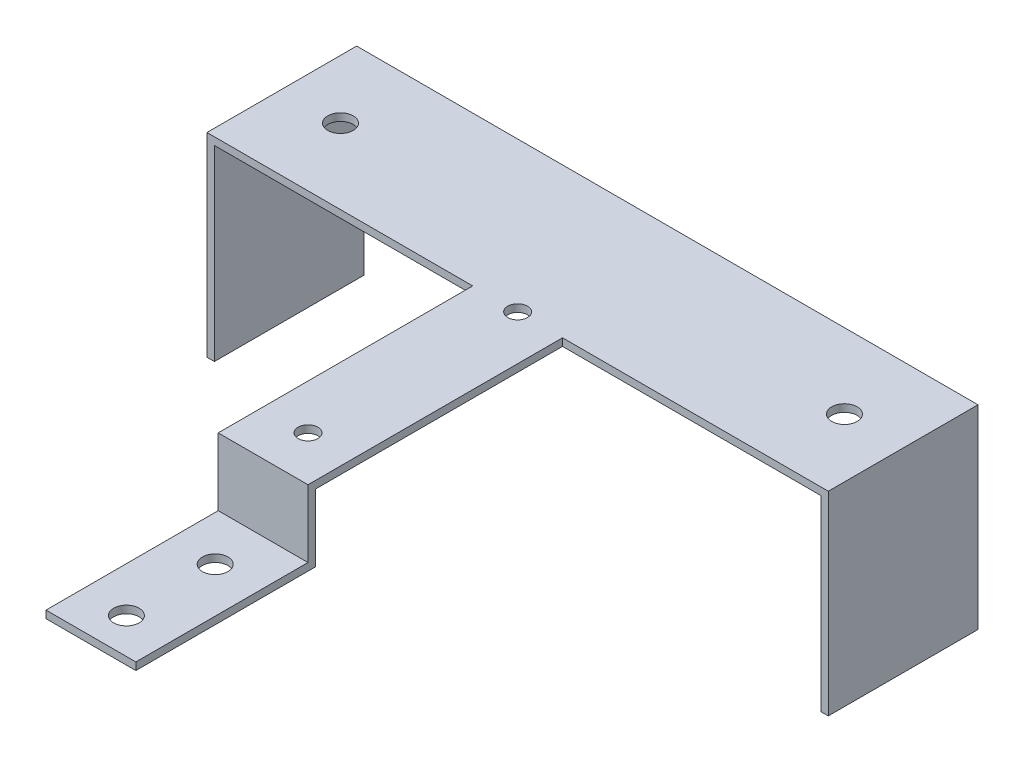
ISO-10303-21;
HEADER;
FILE_DESCRIPTION(('STEP AP214'),'2;1');
FILE_NAME('part.step','',(''),(''),'','','');
FILE_SCHEMA(('AUTOMOTIVE_DESIGN { 1 0 10303 214 1 1 1 1 }'));
ENDSEC;
DATA;
#1=APPLICATION_CONTEXT('core data for automotive mechanical design processes');
#2=APPLICATION_PROTOCOL_DEFINITION('international standard','automotive_design',2000,#1);
#3=PRODUCT_CONTEXT('',#1,'mechanical');
#4=PRODUCT('Part','Part','',(#3));
#5=PRODUCT_RELATED_PRODUCT_CATEGORY('part','',(#4));
#6=PRODUCT_DEFINITION_FORMATION('','',#4);
#7=PRODUCT_DEFINITION_CONTEXT('part definition',#1,'design');
#8=PRODUCT_DEFINITION('design','',#6,#7);
#9=PRODUCT_DEFINITION_SHAPE('','',#8);
#10=(LENGTH_UNIT() NAMED_UNIT(*) SI_UNIT(.MILLI.,.METRE.));
#11=(NAMED_UNIT(*) PLANE_ANGLE_UNIT() SI_UNIT($,.RADIAN.));
#12=(NAMED_UNIT(*) SI_UNIT($,.STERADIAN.) SOLID_ANGLE_UNIT());
#13=UNCERTAINTY_MEASURE_WITH_UNIT(LENGTH_MEASURE(1.E-05),#10,'distance_accuracy_value','');
#14=(GEOMETRIC_REPRESENTATION_CONTEXT(3) GLOBAL_UNCERTAINTY_ASSIGNED_CONTEXT((#13)) GLOBAL_UNIT_ASSIGNED_CONTEXT((#10,
#11,#12)) REPRESENTATION_CONTEXT('',''));
#15=CARTESIAN_POINT('',(0.,0.,0.));
#16=DIRECTION('',(0.,0.,1.));
#17=DIRECTION('',(1.,0.,0.));
#18=AXIS2_PLACEMENT_3D('',#15,#16,#17);
#19=CARTESIAN_POINT('',(0.,0.,0.));
#20=DIRECTION('',(0.,1.,0.));
#21=DIRECTION('',(0.,0.,1.));
#22=AXIS2_PLACEMENT_3D('',#19,#20,#21);
#23=PLANE('',#22);
#24=CARTESIAN_POINT('',(0.,0.,26.67));
#25=DIRECTION('',(0.,1.,0.));
#26=DIRECTION('',(0.,0.,1.));
#27=AXIS2_PLACEMENT_3D('',#24,#25,#26);
#28=CIRCLE('',#27,1.6764);
#29=CARTESIAN_POINT('',(0.,0.,28.3464));
#30=VERTEX_POINT('',#29);
#31=EDGE_CURVE('E265',#30,#30,#28,.T.);
#32=ORIENTED_EDGE('',*,*,#31,.T.);
#33=EDGE_LOOP('',(#32));
#34=FACE_BOUND('',#33,.T.);
#35=CARTESIAN_POINT('',(0.,0.,-8.89000000000001));
#36=DIRECTION('',(0.,1.,0.));
#37=DIRECTION('',(0.,0.,1.));
#38=AXIS2_PLACEMENT_3D('',#35,#36,#37);
#39=CIRCLE('',#38,1.6764);
#40=CARTESIAN_POINT('',(0.,0.,-7.21360000000001));
#41=VERTEX_POINT('',#40);
#42=EDGE_CURVE('E306',#41,#41,#39,.T.);
#43=ORIENTED_EDGE('',*,*,#42,.T.);
#44=EDGE_LOOP('',(#43));
#45=FACE_BOUND('',#44,.T.);
#46=CARTESIAN_POINT('',(-42.7482,0.,-21.59));
#47=DIRECTION('',(0.,1.,0.));
#48=DIRECTION('',(0.,0.,1.));
#49=AXIS2_PLACEMENT_3D('',#46,#47,#48);
#50=CIRCLE('',#49,2.159);
#51=CARTESIAN_POINT('',(-42.7482,0.,-19.431));
#52=VERTEX_POINT('',#51);
#53=EDGE_CURVE('E319',#52,#52,#50,.T.);
#54=ORIENTED_EDGE('',*,*,#53,.T.);
#55=EDGE_LOOP('',(#54));
#56=FACE_BOUND('',#55,.T.);
#57=CARTESIAN_POINT('',(42.7482,0.,-21.59));
#58=DIRECTION('',(0.,1.,0.));
#59=DIRECTION('',(0.,0.,1.));
#60=AXIS2_PLACEMENT_3D('',#57,#58,#59);
#61=CIRCLE('',#60,2.159);
#62=CARTESIAN_POINT('',(42.7482,0.,-19.431));
#63=VERTEX_POINT('',#62);
#64=EDGE_CURVE('E274',#63,#63,#61,.F.);
#65=ORIENTED_EDGE('',*,*,#64,.F.);
#66=EDGE_LOOP('',(#65));
#67=FACE_BOUND('',#66,.T.);
#68=DIRECTION('',(0.,0.,-1.));
#69=VECTOR('',#68,1.);
#70=CARTESIAN_POINT('',(51.435,0.,-8.88999999999998));
#71=LINE('',#70,#69);
#72=CARTESIAN_POINT('',(51.435,0.,-8.88999999999998));
#73=VERTEX_POINT('',#72);
#74=CARTESIAN_POINT('',(51.435,0.,-34.29));
#75=VERTEX_POINT('',#74);
#76=EDGE_CURVE('E75',#73,#75,#71,.T.);
#77=ORIENTED_EDGE('',*,*,#76,.F.);
#78=DIRECTION('',(1.,0.,0.));
#79=VECTOR('',#78,1.);
#80=CARTESIAN_POINT('',(0.,0.,-8.89000000000002));
#81=LINE('',#80,#79);
#82=CARTESIAN_POINT('',(7.62000000000001,0.,-8.89000000000001));
#83=VERTEX_POINT('',#82);
#84=EDGE_CURVE('E311',#83,#73,#81,.T.);
#85=ORIENTED_EDGE('',*,*,#84,.F.);
#86=DIRECTION('',(0.,0.,1.));
#87=VECTOR('',#86,1.);
#88=CARTESIAN_POINT('',(7.62000000000001,0.,0.));
#89=LINE('',#88,#87);
#90=CARTESIAN_POINT('',(7.62000000000001,0.,33.02));
#91=VERTEX_POINT('',#90);
#92=EDGE_CURVE('E309',#83,#91,#89,.T.);
#93=ORIENTED_EDGE('',*,*,#92,.T.);
#94=DIRECTION('',(1.,0.,0.));
#95=VECTOR('',#94,1.);
#96=CARTESIAN_POINT('',(0.,0.,33.02));
#97=LINE('',#96,#95);
#98=CARTESIAN_POINT('',(-7.61999999999999,0.,33.02));
#99=VERTEX_POINT('',#98);
#100=EDGE_CURVE('E257',#99,#91,#97,.T.);
#101=ORIENTED_EDGE('',*,*,#100,.F.);
#102=DIRECTION('',(0.,0.,1.));
#103=VECTOR('',#102,1.);
#104=CARTESIAN_POINT('',(-7.61999999999999,0.,0.));
#105=LINE('',#104,#103);
#106=CARTESIAN_POINT('',(-7.61999999999999,0.,-8.89000000000001));
#107=VERTEX_POINT('',#106);
#108=EDGE_CURVE('E316',#107,#99,#105,.T.);
#109=ORIENTED_EDGE('',*,*,#108,.F.);
#110=DIRECTION('',(1.,0.,0.));
#111=VECTOR('',#110,1.);
#112=CARTESIAN_POINT('',(0.,0.,-8.89000000000002));
#113=LINE('',#112,#111);
#114=CARTESIAN_POINT('',(-51.435,0.,-8.88999999999997));
#115=VERTEX_POINT('',#114);
#116=EDGE_CURVE('E314',#115,#107,#113,.T.);
#117=ORIENTED_EDGE('',*,*,#116,.F.);
#118=DIRECTION('',(0.,0.,-1.));
#119=VECTOR('',#118,1.);
#120=CARTESIAN_POINT('',(-51.435,0.,-8.88999999999997));
#121=LINE('',#120,#119);
#122=CARTESIAN_POINT('',(-51.435,0.,-34.29));
#123=VERTEX_POINT('',#122);
#124=EDGE_CURVE('E207',#115,#123,#121,.T.);
#125=ORIENTED_EDGE('',*,*,#124,.T.);
#126=DIRECTION('',(1.,0.,0.));
#127=VECTOR('',#126,1.);
#128=CARTESIAN_POINT('',(0.,0.,-34.29));
#129=LINE('',#128,#127);
#130=EDGE_CURVE('E80',#123,#75,#129,.T.);
#131=ORIENTED_EDGE('',*,*,#130,.T.);
#132=EDGE_LOOP('',(#77,#85,#93,#101,#109,#117,#125,#131));
#133=FACE_BOUND('',#132,.T.);
#134=ADVANCED_FACE('F60',(#34,#45,#56,#67,#133),#23,.F.);
#135=CARTESIAN_POINT('',(0.,1.27,34.29));
#136=DIRECTION('',(0.,0.,-1.));
#137=DIRECTION('',(-1.,0.,0.));
#138=AXIS2_PLACEMENT_3D('',#135,#136,#137);
#139=PLANE('',#138);
#140=DIRECTION('',(-1.,0.,0.));
#141=VECTOR('',#140,1.);
#142=CARTESIAN_POINT('',(7.62000000000001,-10.16,34.29));
#143=LINE('',#142,#141);
#144=CARTESIAN_POINT('',(7.62000000000001,-10.16,34.29));
#145=VERTEX_POINT('',#144);
#146=CARTESIAN_POINT('',(-7.61999999999999,-10.16,34.29));
#147=VERTEX_POINT('',#146);
#148=EDGE_CURVE('E231',#145,#147,#143,.T.);
#149=ORIENTED_EDGE('',*,*,#148,.F.);
#150=DIRECTION('',(0.,-1.,0.));
#151=VECTOR('',#150,1.);
#152=CARTESIAN_POINT('',(7.62000000000001,1.27,34.29));
#153=LINE('',#152,#151);
#154=CARTESIAN_POINT('',(7.62000000000001,1.27,34.29));
#155=VERTEX_POINT('',#154);
#156=EDGE_CURVE('E303',#155,#145,#153,.T.);
#157=ORIENTED_EDGE('',*,*,#156,.F.);
#158=DIRECTION('',(1.,0.,0.));
#159=VECTOR('',#158,1.);
#160=CARTESIAN_POINT('',(0.,1.27,34.29));
#161=LINE('',#160,#159);
#162=CARTESIAN_POINT('',(-7.61999999999999,1.27,34.29));
#163=VERTEX_POINT('',#162);
#164=EDGE_CURVE('E295',#163,#155,#161,.T.);
#165=ORIENTED_EDGE('',*,*,#164,.F.);
#166=DIRECTION('',(0.,-1.,0.));
#167=VECTOR('',#166,1.);
#168=CARTESIAN_POINT('',(-7.61999999999999,1.27,34.29));
#169=LINE('',#168,#167);
#170=EDGE_CURVE('E326',#163,#147,#169,.T.);
#171=ORIENTED_EDGE('',*,*,#170,.T.);
#172=EDGE_LOOP('',(#149,#157,#165,#171));
#173=FACE_BOUND('',#172,.T.);
#174=ADVANCED_FACE('F378',(#173),#139,.F.);
#175=CARTESIAN_POINT('',(7.62000000000001,1.27,0.));
#176=DIRECTION('',(1.,0.,0.));
#177=DIRECTION('',(0.,0.,-1.));
#178=AXIS2_PLACEMENT_3D('',#175,#176,#177);
#179=PLANE('',#178);
#180=ORIENTED_EDGE('',*,*,#92,.F.);
#181=DIRECTION('',(0.,-1.,0.));
#182=VECTOR('',#181,1.);
#183=CARTESIAN_POINT('',(7.62000000000001,1.27,-8.89000000000001));
#184=LINE('',#183,#182);
#185=CARTESIAN_POINT('',(7.62000000000001,1.27,-8.89000000000001));
#186=VERTEX_POINT('',#185);
#187=EDGE_CURVE('E12',#186,#83,#184,.T.);
#188=ORIENTED_EDGE('',*,*,#187,.F.);
#189=DIRECTION('',(0.,0.,1.));
#190=VECTOR('',#189,1.);
#191=CARTESIAN_POINT('',(7.62000000000001,1.27,0.));
#192=LINE('',#191,#190);
#193=EDGE_CURVE('E277',#186,#155,#192,.T.);
#194=ORIENTED_EDGE('',*,*,#193,.T.);
#195=ORIENTED_EDGE('',*,*,#156,.T.);
#196=DIRECTION('',(0.,0.,-1.));
#197=VECTOR('',#196,1.);
#198=CARTESIAN_POINT('',(7.62000000000001,-10.16,63.5));
#199=LINE('',#198,#197);
#200=CARTESIAN_POINT('',(7.62000000000001,-10.16,63.5));
#201=VERTEX_POINT('',#200);
#202=EDGE_CURVE('E250',#201,#145,#199,.T.);
#203=ORIENTED_EDGE('',*,*,#202,.F.);
#204=DIRECTION('',(0.,1.,0.));
#205=VECTOR('',#204,1.);
#206=CARTESIAN_POINT('',(7.62000000000001,-11.43,63.5));
#207=LINE('',#206,#205);
#208=CARTESIAN_POINT('',(7.62000000000001,-11.43,63.5));
#209=VERTEX_POINT('',#208);
#210=EDGE_CURVE('E234',#209,#201,#207,.T.);
#211=ORIENTED_EDGE('',*,*,#210,.F.);
#212=DIRECTION('',(0.,0.,-1.));
#213=VECTOR('',#212,1.);
#214=CARTESIAN_POINT('',(7.62000000000001,-11.43,34.29));
#215=LINE('',#214,#213);
#216=CARTESIAN_POINT('',(7.62000000000001,-11.43,33.02));
#217=VERTEX_POINT('',#216);
#218=EDGE_CURVE('E253',#209,#217,#215,.T.);
#219=ORIENTED_EDGE('',*,*,#218,.T.);
#220=DIRECTION('',(0.,1.,0.));
#221=VECTOR('',#220,1.);
#222=CARTESIAN_POINT('',(7.62000000000001,-11.43,33.02));
#223=LINE('',#222,#221);
#224=EDGE_CURVE('E262',#217,#91,#223,.T.);
#225=ORIENTED_EDGE('',*,*,#224,.T.);
#226=EDGE_LOOP('',(#180,#188,#194,#195,#203,#211,#219,#225));
#227=FACE_BOUND('',#226,.T.);
#228=ADVANCED_FACE('F344',(#227),#179,.T.);
#229=CARTESIAN_POINT('',(0.,1.27,-8.89000000000002));
#230=DIRECTION('',(0.,0.,-1.));
#231=DIRECTION('',(-1.,0.,0.));
#232=AXIS2_PLACEMENT_3D('',#229,#230,#231);
#233=PLANE('',#232);
#234=ORIENTED_EDGE('',*,*,#84,.T.);
#235=DIRECTION('',(0.,1.,0.));
#236=VECTOR('',#235,1.);
#237=CARTESIAN_POINT('',(51.435,-31.75,-8.88999999999998));
#238=LINE('',#237,#236);
#239=CARTESIAN_POINT('',(51.435,-31.75,-8.88999999999998));
#240=VERTEX_POINT('',#239);
#241=EDGE_CURVE('E188',#240,#73,#238,.T.);
#242=ORIENTED_EDGE('',*,*,#241,.F.);
#243=DIRECTION('',(-1.,0.,0.));
#244=VECTOR('',#243,1.);
#245=CARTESIAN_POINT('',(52.705,-31.75,-8.88999999999998));
#246=LINE('',#245,#244);
#247=CARTESIAN_POINT('',(52.705,-31.75,-8.88999999999998));
#248=VERTEX_POINT('',#247);
#249=EDGE_CURVE('E185',#248,#240,#246,.T.);
#250=ORIENTED_EDGE('',*,*,#249,.F.);
#251=DIRECTION('',(0.,-1.,0.));
#252=VECTOR('',#251,1.);
#253=CARTESIAN_POINT('',(52.705,1.27,-8.88999999999998));
#254=LINE('',#253,#252);
#255=CARTESIAN_POINT('',(52.705,1.27,-8.88999999999998));
#256=VERTEX_POINT('',#255);
#257=EDGE_CURVE('E68',#256,#248,#254,.T.);
#258=ORIENTED_EDGE('',*,*,#257,.F.);
#259=DIRECTION('',(1.,0.,0.));
#260=VECTOR('',#259,1.);
#261=CARTESIAN_POINT('',(0.,1.27,-8.89000000000002));
#262=LINE('',#261,#260);
#263=EDGE_CURVE('E280',#186,#256,#262,.T.);
#264=ORIENTED_EDGE('',*,*,#263,.F.);
#265=ORIENTED_EDGE('',*,*,#187,.T.);
#266=EDGE_LOOP('',(#234,#242,#250,#258,#264,#265));
#267=FACE_BOUND('',#266,.T.);
#268=ADVANCED_FACE('F186',(#267),#233,.F.);
#269=CARTESIAN_POINT('',(52.705,1.27,0.));
#270=DIRECTION('',(1.,0.,0.));
#271=DIRECTION('',(0.,0.,-1.));
#272=AXIS2_PLACEMENT_3D('',#269,#270,#271);
#273=PLANE('',#272);
#274=ORIENTED_EDGE('',*,*,#257,.T.);
#275=DIRECTION('',(0.,0.,-1.));
#276=VECTOR('',#275,1.);
#277=CARTESIAN_POINT('',(52.705,-31.75,-8.88999999999998));
#278=LINE('',#277,#276);
#279=CARTESIAN_POINT('',(52.705,-31.75,-34.29));
#280=VERTEX_POINT('',#279);
#281=EDGE_CURVE('E177',#248,#280,#278,.T.);
#282=ORIENTED_EDGE('',*,*,#281,.T.);
#283=DIRECTION('',(0.,-1.,0.));
#284=VECTOR('',#283,1.);
#285=CARTESIAN_POINT('',(52.705,1.27,-34.29));
#286=LINE('',#285,#284);
#287=CARTESIAN_POINT('',(52.705,1.27,-34.29));
#288=VERTEX_POINT('',#287);
#289=EDGE_CURVE('E182',#288,#280,#286,.T.);
#290=ORIENTED_EDGE('',*,*,#289,.F.);
#291=DIRECTION('',(0.,0.,1.));
#292=VECTOR('',#291,1.);
#293=CARTESIAN_POINT('',(52.705,1.27,0.));
#294=LINE('',#293,#292);
#295=EDGE_CURVE('E179',#288,#256,#294,.T.);
#296=ORIENTED_EDGE('',*,*,#295,.T.);
#297=EDGE_LOOP('',(#274,#282,#290,#296));
#298=FACE_BOUND('',#297,.T.);
#299=ADVANCED_FACE('F175',(#298),#273,.T.);
#300=CARTESIAN_POINT('',(0.,1.27,-34.29));
#301=DIRECTION('',(0.,0.,-1.));
#302=DIRECTION('',(-1.,0.,0.));
#303=AXIS2_PLACEMENT_3D('',#300,#301,#302);
#304=PLANE('',#303);
#305=ORIENTED_EDGE('',*,*,#130,.F.);
#306=DIRECTION('',(0.,1.,0.));
#307=VECTOR('',#306,1.);
#308=CARTESIAN_POINT('',(-51.435,-31.75,-34.29));
#309=LINE('',#308,#307);
#310=CARTESIAN_POINT('',(-51.435,-31.75,-34.29));
#311=VERTEX_POINT('',#310);
#312=EDGE_CURVE('E217',#311,#123,#309,.T.);
#313=ORIENTED_EDGE('',*,*,#312,.F.);
#314=DIRECTION('',(1.,0.,0.));
#315=VECTOR('',#314,1.);
#316=CARTESIAN_POINT('',(-52.705,-31.75,-34.29));
#317=LINE('',#316,#315);
#318=CARTESIAN_POINT('',(-52.705,-31.75,-34.29));
#319=VERTEX_POINT('',#318);
#320=EDGE_CURVE('E210',#319,#311,#317,.T.);
#321=ORIENTED_EDGE('',*,*,#320,.F.);
#322=DIRECTION('',(0.,-1.,0.));
#323=VECTOR('',#322,1.);
#324=CARTESIAN_POINT('',(-52.705,1.27,-34.29));
#325=LINE('',#324,#323);
#326=CARTESIAN_POINT('',(-52.705,1.27,-34.29));
#327=VERTEX_POINT('',#326);
#328=EDGE_CURVE('E333',#327,#319,#325,.T.);
#329=ORIENTED_EDGE('',*,*,#328,.F.);
#330=DIRECTION('',(1.,0.,0.));
#331=VECTOR('',#330,1.);
#332=CARTESIAN_POINT('',(0.,1.27,-34.29));
#333=LINE('',#332,#331);
#334=EDGE_CURVE('E283',#327,#288,#333,.T.);
#335=ORIENTED_EDGE('',*,*,#334,.T.);
#336=ORIENTED_EDGE('',*,*,#289,.T.);
#337=DIRECTION('',(-1.,0.,0.));
#338=VECTOR('',#337,1.);
#339=CARTESIAN_POINT('',(52.705,-31.75,-34.29));
#340=LINE('',#339,#338);
#341=CARTESIAN_POINT('',(51.435,-31.75,-34.29));
#342=VERTEX_POINT('',#341);
#343=EDGE_CURVE('E195',#280,#342,#340,.T.);
#344=ORIENTED_EDGE('',*,*,#343,.T.);
#345=DIRECTION('',(0.,1.,0.));
#346=VECTOR('',#345,1.);
#347=CARTESIAN_POINT('',(51.435,-31.75,-34.29));
#348=LINE('',#347,#346);
#349=EDGE_CURVE('E196',#342,#75,#348,.T.);
#350=ORIENTED_EDGE('',*,*,#349,.T.);
#351=EDGE_LOOP('',(#305,#313,#321,#329,#335,#336,#344,#350));
#352=FACE_BOUND('',#351,.T.);
#353=ADVANCED_FACE('F336',(#352),#304,.T.);
#354=CARTESIAN_POINT('',(-52.705,1.27,0.));
#355=DIRECTION('',(1.,0.,0.));
#356=DIRECTION('',(0.,0.,-1.));
#357=AXIS2_PLACEMENT_3D('',#354,#355,#356);
#358=PLANE('',#357);
#359=ORIENTED_EDGE('',*,*,#328,.T.);
#360=DIRECTION('',(0.,0.,-1.));
#361=VECTOR('',#360,1.);
#362=CARTESIAN_POINT('',(-52.705,-31.75,-8.88999999999997));
#363=LINE('',#362,#361);
#364=CARTESIAN_POINT('',(-52.705,-31.75,-8.88999999999997));
#365=VERTEX_POINT('',#364);
#366=EDGE_CURVE('E212',#365,#319,#363,.T.);
#367=ORIENTED_EDGE('',*,*,#366,.F.);
#368=DIRECTION('',(0.,-1.,0.));
#369=VECTOR('',#368,1.);
#370=CARTESIAN_POINT('',(-52.705,1.27,-8.88999999999997));
#371=LINE('',#370,#369);
#372=CARTESIAN_POINT('',(-52.705,1.27,-8.88999999999997));
#373=VERTEX_POINT('',#372);
#374=EDGE_CURVE('E331',#373,#365,#371,.T.);
#375=ORIENTED_EDGE('',*,*,#374,.F.);
#376=DIRECTION('',(0.,0.,1.));
#377=VECTOR('',#376,1.);
#378=CARTESIAN_POINT('',(-52.705,1.27,0.));
#379=LINE('',#378,#377);
#380=EDGE_CURVE('E286',#327,#373,#379,.T.);
#381=ORIENTED_EDGE('',*,*,#380,.F.);
#382=EDGE_LOOP('',(#359,#367,#375,#381));
#383=FACE_BOUND('',#382,.T.);
#384=ADVANCED_FACE('F403',(#383),#358,.F.);
#385=CARTESIAN_POINT('',(0.,1.27,-8.89000000000002));
#386=DIRECTION('',(0.,0.,-1.));
#387=DIRECTION('',(-1.,0.,0.));
#388=AXIS2_PLACEMENT_3D('',#385,#386,#387);
#389=PLANE('',#388);
#390=ORIENTED_EDGE('',*,*,#374,.T.);
#391=DIRECTION('',(1.,0.,0.));
#392=VECTOR('',#391,1.);
#393=CARTESIAN_POINT('',(-52.705,-31.75,-8.88999999999997));
#394=LINE('',#393,#392);
#395=CARTESIAN_POINT('',(-51.435,-31.75,-8.88999999999997));
#396=VERTEX_POINT('',#395);
#397=EDGE_CURVE('E203',#365,#396,#394,.T.);
#398=ORIENTED_EDGE('',*,*,#397,.T.);
#399=DIRECTION('',(0.,1.,0.));
#400=VECTOR('',#399,1.);
#401=CARTESIAN_POINT('',(-51.435,-31.75,-8.88999999999997));
#402=LINE('',#401,#400);
#403=EDGE_CURVE('E215',#396,#115,#402,.T.);
#404=ORIENTED_EDGE('',*,*,#403,.T.);
#405=ORIENTED_EDGE('',*,*,#116,.T.);
#406=DIRECTION('',(0.,-1.,0.));
#407=VECTOR('',#406,1.);
#408=CARTESIAN_POINT('',(-7.61999999999999,1.27,-8.89000000000001));
#409=LINE('',#408,#407);
#410=CARTESIAN_POINT('',(-7.61999999999999,1.27,-8.89000000000001));
#411=VERTEX_POINT('',#410);
#412=EDGE_CURVE('E328',#411,#107,#409,.T.);
#413=ORIENTED_EDGE('',*,*,#412,.F.);
#414=DIRECTION('',(1.,0.,0.));
#415=VECTOR('',#414,1.);
#416=CARTESIAN_POINT('',(0.,1.27,-8.89000000000002));
#417=LINE('',#416,#415);
#418=EDGE_CURVE('E289',#373,#411,#417,.T.);
#419=ORIENTED_EDGE('',*,*,#418,.F.);
#420=EDGE_LOOP('',(#390,#398,#404,#405,#413,#419));
#421=FACE_BOUND('',#420,.T.);
#422=ADVANCED_FACE('F358',(#421),#389,.F.);
#423=CARTESIAN_POINT('',(-7.61999999999999,1.27,0.));
#424=DIRECTION('',(1.,0.,0.));
#425=DIRECTION('',(0.,0.,-1.));
#426=AXIS2_PLACEMENT_3D('',#423,#424,#425);
#427=PLANE('',#426);
#428=ORIENTED_EDGE('',*,*,#108,.T.);
#429=DIRECTION('',(0.,1.,0.));
#430=VECTOR('',#429,1.);
#431=CARTESIAN_POINT('',(-7.61999999999999,-11.43,33.02));
#432=LINE('',#431,#430);
#433=CARTESIAN_POINT('',(-7.61999999999999,-11.43,33.02));
#434=VERTEX_POINT('',#433);
#435=EDGE_CURVE('E259',#434,#99,#432,.T.);
#436=ORIENTED_EDGE('',*,*,#435,.F.);
#437=DIRECTION('',(0.,0.,-1.));
#438=VECTOR('',#437,1.);
#439=CARTESIAN_POINT('',(-7.61999999999999,-11.43,0.));
#440=LINE('',#439,#438);
#441=CARTESIAN_POINT('',(-7.61999999999999,-11.43,63.5));
#442=VERTEX_POINT('',#441);
#443=EDGE_CURVE('E254',#442,#434,#440,.T.);
#444=ORIENTED_EDGE('',*,*,#443,.F.);
#445=DIRECTION('',(0.,-1.,0.));
#446=VECTOR('',#445,1.);
#447=CARTESIAN_POINT('',(-7.61999999999999,-11.43,63.5));
#448=LINE('',#447,#446);
#449=CARTESIAN_POINT('',(-7.61999999999999,-10.16,63.5));
#450=VERTEX_POINT('',#449);
#451=EDGE_CURVE('E239',#450,#442,#448,.T.);
#452=ORIENTED_EDGE('',*,*,#451,.F.);
#453=DIRECTION('',(0.,0.,-1.));
#454=VECTOR('',#453,1.);
#455=CARTESIAN_POINT('',(-7.61999999999999,-10.16,63.5));
#456=LINE('',#455,#454);
#457=EDGE_CURVE('E245',#450,#147,#456,.T.);
#458=ORIENTED_EDGE('',*,*,#457,.T.);
#459=ORIENTED_EDGE('',*,*,#170,.F.);
#460=DIRECTION('',(0.,0.,1.));
#461=VECTOR('',#460,1.);
#462=CARTESIAN_POINT('',(-7.61999999999999,1.27,0.));
#463=LINE('',#462,#461);
#464=EDGE_CURVE('E292',#411,#163,#463,.T.);
#465=ORIENTED_EDGE('',*,*,#464,.F.);
#466=ORIENTED_EDGE('',*,*,#412,.T.);
#467=EDGE_LOOP('',(#428,#436,#444,#452,#458,#459,#465,#466));
#468=FACE_BOUND('',#467,.T.);
#469=ADVANCED_FACE('F354',(#468),#427,.F.);
#470=CARTESIAN_POINT('',(-42.7482,1.27,-21.59));
#471=DIRECTION('',(0.,-1.,0.));
#472=DIRECTION('',(0.,0.,-1.));
#473=AXIS2_PLACEMENT_3D('',#470,#471,#472);
#474=CYLINDRICAL_SURFACE('',#473,2.159);
#475=CARTESIAN_POINT('',(-42.7482,1.27,-21.59));
#476=DIRECTION('',(0.,1.,0.));
#477=DIRECTION('',(0.,0.,1.));
#478=AXIS2_PLACEMENT_3D('',#475,#476,#477);
#479=CIRCLE('',#478,2.159);
#480=CARTESIAN_POINT('',(-42.7482,1.27,-19.431));
#481=VERTEX_POINT('',#480);
#482=EDGE_CURVE('E297',#481,#481,#479,.T.);
#483=ORIENTED_EDGE('',*,*,#482,.T.);
#484=EDGE_LOOP('',(#483));
#485=FACE_BOUND('',#484,.T.);
#486=ORIENTED_EDGE('',*,*,#53,.F.);
#487=EDGE_LOOP('',(#486));
#488=FACE_BOUND('',#487,.T.);
#489=ADVANCED_FACE('F394',(#485,#488),#474,.F.);
#490=CARTESIAN_POINT('',(0.,1.27,-8.89000000000001));
#491=DIRECTION('',(0.,-1.,0.));
#492=DIRECTION('',(0.,0.,-1.));
#493=AXIS2_PLACEMENT_3D('',#490,#491,#492);
#494=CYLINDRICAL_SURFACE('',#493,1.6764);
#495=CARTESIAN_POINT('',(0.,1.27,-8.89000000000001));
#496=DIRECTION('',(0.,1.,0.));
#497=DIRECTION('',(0.,0.,1.));
#498=AXIS2_PLACEMENT_3D('',#495,#496,#497);
#499=CIRCLE('',#498,1.6764);
#500=CARTESIAN_POINT('',(0.,1.27,-7.21360000000001));
#501=VERTEX_POINT('',#500);
#502=EDGE_CURVE('E273',#501,#501,#499,.T.);
#503=ORIENTED_EDGE('',*,*,#502,.T.);
#504=EDGE_LOOP('',(#503));
#505=FACE_BOUND('',#504,.T.);
#506=ORIENTED_EDGE('',*,*,#42,.F.);
#507=EDGE_LOOP('',(#506));
#508=FACE_BOUND('',#507,.T.);
#509=ADVANCED_FACE('F396',(#505,#508),#494,.F.);
#510=CARTESIAN_POINT('',(0.,1.27,26.67));
#511=DIRECTION('',(0.,-1.,0.));
#512=DIRECTION('',(0.,0.,-1.));
#513=AXIS2_PLACEMENT_3D('',#510,#511,#512);
#514=CYLINDRICAL_SURFACE('',#513,1.6764);
#515=CARTESIAN_POINT('',(0.,1.27,26.67));
#516=DIRECTION('',(0.,1.,0.));
#517=DIRECTION('',(0.,0.,1.));
#518=AXIS2_PLACEMENT_3D('',#515,#516,#517);
#519=CIRCLE('',#518,1.6764);
#520=CARTESIAN_POINT('',(0.,1.27,28.3464));
#521=VERTEX_POINT('',#520);
#522=EDGE_CURVE('E270',#521,#521,#519,.T.);
#523=ORIENTED_EDGE('',*,*,#522,.T.);
#524=EDGE_LOOP('',(#523));
#525=FACE_BOUND('',#524,.T.);
#526=ORIENTED_EDGE('',*,*,#31,.F.);
#527=EDGE_LOOP('',(#526));
#528=FACE_BOUND('',#527,.T.);
#529=ADVANCED_FACE('F62',(#525,#528),#514,.F.);
#530=CARTESIAN_POINT('',(42.7482,1.27,-21.59));
#531=DIRECTION('',(0.,-1.,0.));
#532=DIRECTION('',(0.,0.,-1.));
#533=AXIS2_PLACEMENT_3D('',#530,#531,#532);
#534=CYLINDRICAL_SURFACE('',#533,2.159);
#535=CARTESIAN_POINT('',(42.7482,1.27,-21.59));
#536=DIRECTION('',(0.,1.,0.));
#537=DIRECTION('',(0.,0.,1.));
#538=AXIS2_PLACEMENT_3D('',#535,#536,#537);
#539=CIRCLE('',#538,2.159);
#540=CARTESIAN_POINT('',(42.7482,1.27,-19.431));
#541=VERTEX_POINT('',#540);
#542=EDGE_CURVE('E300',#541,#541,#539,.F.);
#543=ORIENTED_EDGE('',*,*,#542,.F.);
#544=EDGE_LOOP('',(#543));
#545=FACE_BOUND('',#544,.T.);
#546=ORIENTED_EDGE('',*,*,#64,.T.);
#547=EDGE_LOOP('',(#546));
#548=FACE_BOUND('',#547,.T.);
#549=ADVANCED_FACE('F390',(#545,#548),#534,.F.);
#550=CARTESIAN_POINT('',(0.,1.27,0.));
#551=DIRECTION('',(0.,1.,0.));
#552=DIRECTION('',(0.,0.,1.));
#553=AXIS2_PLACEMENT_3D('',#550,#551,#552);
#554=PLANE('',#553);
#555=ORIENTED_EDGE('',*,*,#522,.F.);
#556=EDGE_LOOP('',(#555));
#557=FACE_BOUND('',#556,.T.);
#558=ORIENTED_EDGE('',*,*,#502,.F.);
#559=EDGE_LOOP('',(#558));
#560=FACE_BOUND('',#559,.T.);
#561=ORIENTED_EDGE('',*,*,#193,.F.);
#562=ORIENTED_EDGE('',*,*,#263,.T.);
#563=ORIENTED_EDGE('',*,*,#295,.F.);
#564=ORIENTED_EDGE('',*,*,#334,.F.);
#565=ORIENTED_EDGE('',*,*,#380,.T.);
#566=ORIENTED_EDGE('',*,*,#418,.T.);
#567=ORIENTED_EDGE('',*,*,#464,.T.);
#568=ORIENTED_EDGE('',*,*,#164,.T.);
#569=EDGE_LOOP('',(#561,#562,#563,#564,#565,#566,#567,#568));
#570=FACE_BOUND('',#569,.T.);
#571=ORIENTED_EDGE('',*,*,#482,.F.);
#572=EDGE_LOOP('',(#571));
#573=FACE_BOUND('',#572,.T.);
#574=ORIENTED_EDGE('',*,*,#542,.T.);
#575=EDGE_LOOP('',(#574));
#576=FACE_BOUND('',#575,.T.);
#577=ADVANCED_FACE('F340',(#557,#560,#570,#573,#576),#554,.T.);
#578=CARTESIAN_POINT('',(0.,-11.43,33.02));
#579=DIRECTION('',(0.,0.,1.));
#580=DIRECTION('',(1.,0.,0.));
#581=AXIS2_PLACEMENT_3D('',#578,#579,#580);
#582=PLANE('',#581);
#583=ORIENTED_EDGE('',*,*,#100,.T.);
#584=ORIENTED_EDGE('',*,*,#224,.F.);
#585=DIRECTION('',(1.,0.,0.));
#586=VECTOR('',#585,1.);
#587=CARTESIAN_POINT('',(0.,-11.43,33.02));
#588=LINE('',#587,#586);
#589=EDGE_CURVE('E256',#434,#217,#588,.T.);
#590=ORIENTED_EDGE('',*,*,#589,.F.);
#591=ORIENTED_EDGE('',*,*,#435,.T.);
#592=EDGE_LOOP('',(#583,#584,#590,#591));
#593=FACE_BOUND('',#592,.T.);
#594=ADVANCED_FACE('F349',(#593),#582,.F.);
#595=CARTESIAN_POINT('',(0.,-11.43,0.));
#596=DIRECTION('',(0.,-1.,0.));
#597=DIRECTION('',(0.,0.,-1.));
#598=AXIS2_PLACEMENT_3D('',#595,#596,#597);
#599=PLANE('',#598);
#600=CARTESIAN_POINT('',(0.,-11.43,57.4802));
#601=DIRECTION('',(0.,-1.,0.));
#602=DIRECTION('',(0.,0.,-1.));
#603=AXIS2_PLACEMENT_3D('',#600,#601,#602);
#604=CIRCLE('',#603,2.159);
#605=CARTESIAN_POINT('',(0.,-11.43,55.3212));
#606=VERTEX_POINT('',#605);
#607=EDGE_CURVE('E219',#606,#606,#604,.F.);
#608=ORIENTED_EDGE('',*,*,#607,.T.);
#609=EDGE_LOOP('',(#608));
#610=FACE_BOUND('',#609,.T.);
#611=CARTESIAN_POINT('',(0.,-11.43,42.418));
#612=DIRECTION('',(0.,-1.,0.));
#613=DIRECTION('',(0.,0.,-1.));
#614=AXIS2_PLACEMENT_3D('',#611,#612,#613);
#615=CIRCLE('',#614,2.159);
#616=CARTESIAN_POINT('',(0.,-11.43,40.259));
#617=VERTEX_POINT('',#616);
#618=EDGE_CURVE('E225',#617,#617,#615,.F.);
#619=ORIENTED_EDGE('',*,*,#618,.T.);
#620=EDGE_LOOP('',(#619));
#621=FACE_BOUND('',#620,.T.);
#622=ORIENTED_EDGE('',*,*,#589,.T.);
#623=ORIENTED_EDGE('',*,*,#218,.F.);
#624=DIRECTION('',(1.,0.,0.));
#625=VECTOR('',#624,1.);
#626=CARTESIAN_POINT('',(7.62000000000001,-11.43,63.5));
#627=LINE('',#626,#625);
#628=EDGE_CURVE('E242',#442,#209,#627,.T.);
#629=ORIENTED_EDGE('',*,*,#628,.F.);
#630=ORIENTED_EDGE('',*,*,#443,.T.);
#631=EDGE_LOOP('',(#622,#623,#629,#630));
#632=FACE_BOUND('',#631,.T.);
#633=ADVANCED_FACE('F435',(#610,#621,#632),#599,.T.);
#634=CARTESIAN_POINT('',(7.62000000000001,-10.16,63.5));
#635=DIRECTION('',(0.,-1.,0.));
#636=DIRECTION('',(1.,0.,0.));
#637=AXIS2_PLACEMENT_3D('',#634,#635,#636);
#638=PLANE('',#637);
#639=CARTESIAN_POINT('',(0.,-10.16,57.4802));
#640=DIRECTION('',(0.,1.,0.));
#641=DIRECTION('',(-1.,0.,0.));
#642=AXIS2_PLACEMENT_3D('',#639,#640,#641);
#643=CIRCLE('',#642,2.159);
#644=CARTESIAN_POINT('',(-2.159,-10.16,57.4802));
#645=VERTEX_POINT('',#644);
#646=EDGE_CURVE('E222',#645,#645,#643,.T.);
#647=ORIENTED_EDGE('',*,*,#646,.F.);
#648=EDGE_LOOP('',(#647));
#649=FACE_BOUND('',#648,.T.);
#650=CARTESIAN_POINT('',(0.,-10.16,42.418));
#651=DIRECTION('',(0.,1.,0.));
#652=DIRECTION('',(-1.,0.,0.));
#653=AXIS2_PLACEMENT_3D('',#650,#651,#652);
#654=CIRCLE('',#653,2.159);
#655=CARTESIAN_POINT('',(-2.159,-10.16,42.418));
#656=VERTEX_POINT('',#655);
#657=EDGE_CURVE('E228',#656,#656,#654,.T.);
#658=ORIENTED_EDGE('',*,*,#657,.F.);
#659=EDGE_LOOP('',(#658));
#660=FACE_BOUND('',#659,.T.);
#661=ORIENTED_EDGE('',*,*,#148,.T.);
#662=ORIENTED_EDGE('',*,*,#457,.F.);
#663=DIRECTION('',(-1.,0.,0.));
#664=VECTOR('',#663,1.);
#665=CARTESIAN_POINT('',(7.62000000000001,-10.16,63.5));
#666=LINE('',#665,#664);
#667=EDGE_CURVE('E237',#201,#450,#666,.T.);
#668=ORIENTED_EDGE('',*,*,#667,.F.);
#669=ORIENTED_EDGE('',*,*,#202,.T.);
#670=EDGE_LOOP('',(#661,#662,#668,#669));
#671=FACE_BOUND('',#670,.T.);
#672=ADVANCED_FACE('F442',(#649,#660,#671),#638,.F.);
#673=CARTESIAN_POINT('',(0.,0.,63.5));
#674=DIRECTION('',(0.,0.,1.));
#675=DIRECTION('',(1.,0.,0.));
#676=AXIS2_PLACEMENT_3D('',#673,#674,#675);
#677=PLANE('',#676);
#678=ORIENTED_EDGE('',*,*,#210,.T.);
#679=ORIENTED_EDGE('',*,*,#667,.T.);
#680=ORIENTED_EDGE('',*,*,#451,.T.);
#681=ORIENTED_EDGE('',*,*,#628,.T.);
#682=EDGE_LOOP('',(#678,#679,#680,#681));
#683=FACE_BOUND('',#682,.T.);
#684=ADVANCED_FACE('F448',(#683),#677,.T.);
#685=CARTESIAN_POINT('',(0.,-11.431,42.418));
#686=DIRECTION('',(0.,1.,0.));
#687=DIRECTION('',(-1.,0.,0.));
#688=AXIS2_PLACEMENT_3D('',#685,#686,#687);
#689=CYLINDRICAL_SURFACE('',#688,2.159);
#690=ORIENTED_EDGE('',*,*,#618,.F.);
#691=EDGE_LOOP('',(#690));
#692=FACE_BOUND('',#691,.T.);
#693=ORIENTED_EDGE('',*,*,#657,.T.);
#694=EDGE_LOOP('',(#693));
#695=FACE_BOUND('',#694,.T.);
#696=ADVANCED_FACE('F452',(#692,#695),#689,.F.);
#697=CARTESIAN_POINT('',(0.,-11.431,57.4802));
#698=DIRECTION('',(0.,1.,0.));
#699=DIRECTION('',(-1.,0.,0.));
#700=AXIS2_PLACEMENT_3D('',#697,#698,#699);
#701=CYLINDRICAL_SURFACE('',#700,2.159);
#702=ORIENTED_EDGE('',*,*,#607,.F.);
#703=EDGE_LOOP('',(#702));
#704=FACE_BOUND('',#703,.T.);
#705=ORIENTED_EDGE('',*,*,#646,.T.);
#706=EDGE_LOOP('',(#705));
#707=FACE_BOUND('',#706,.T.);
#708=ADVANCED_FACE('F456',(#704,#707),#701,.F.);
#709=CARTESIAN_POINT('',(-51.435,-31.75,-8.88999999999997));
#710=DIRECTION('',(1.,0.,0.));
#711=DIRECTION('',(0.,0.,-1.));
#712=AXIS2_PLACEMENT_3D('',#709,#710,#711);
#713=PLANE('',#712);
#714=ORIENTED_EDGE('',*,*,#124,.F.);
#715=ORIENTED_EDGE('',*,*,#403,.F.);
#716=DIRECTION('',(0.,0.,-1.));
#717=VECTOR('',#716,1.);
#718=CARTESIAN_POINT('',(-51.435,-31.75,-8.88999999999997));
#719=LINE('',#718,#717);
#720=EDGE_CURVE('E206',#396,#311,#719,.T.);
#721=ORIENTED_EDGE('',*,*,#720,.T.);
#722=ORIENTED_EDGE('',*,*,#312,.T.);
#723=EDGE_LOOP('',(#714,#715,#721,#722));
#724=FACE_BOUND('',#723,.T.);
#725=ADVANCED_FACE('F374',(#724),#713,.T.);
#726=CARTESIAN_POINT('',(0.,-31.75,0.));
#727=DIRECTION('',(0.,1.,0.));
#728=DIRECTION('',(0.,0.,1.));
#729=AXIS2_PLACEMENT_3D('',#726,#727,#728);
#730=PLANE('',#729);
#731=ORIENTED_EDGE('',*,*,#397,.F.);
#732=ORIENTED_EDGE('',*,*,#366,.T.);
#733=ORIENTED_EDGE('',*,*,#320,.T.);
#734=ORIENTED_EDGE('',*,*,#720,.F.);
#735=EDGE_LOOP('',(#731,#732,#733,#734));
#736=FACE_BOUND('',#735,.T.);
#737=ADVANCED_FACE('F367',(#736),#730,.F.);
#738=CARTESIAN_POINT('',(51.435,-31.75,-8.88999999999998));
#739=DIRECTION('',(1.,0.,0.));
#740=DIRECTION('',(0.,0.,-1.));
#741=AXIS2_PLACEMENT_3D('',#738,#739,#740);
#742=PLANE('',#741);
#743=ORIENTED_EDGE('',*,*,#76,.T.);
#744=ORIENTED_EDGE('',*,*,#349,.F.);
#745=DIRECTION('',(0.,0.,-1.));
#746=VECTOR('',#745,1.);
#747=CARTESIAN_POINT('',(51.435,-31.75,-8.88999999999998));
#748=LINE('',#747,#746);
#749=EDGE_CURVE('E190',#240,#342,#748,.T.);
#750=ORIENTED_EDGE('',*,*,#749,.F.);
#751=ORIENTED_EDGE('',*,*,#241,.T.);
#752=EDGE_LOOP('',(#743,#744,#750,#751));
#753=FACE_BOUND('',#752,.T.);
#754=ADVANCED_FACE('F364',(#753),#742,.F.);
#755=CARTESIAN_POINT('',(0.,-31.75,0.));
#756=DIRECTION('',(0.,-1.,0.));
#757=DIRECTION('',(0.,0.,-1.));
#758=AXIS2_PLACEMENT_3D('',#755,#756,#757);
#759=PLANE('',#758);
#760=ORIENTED_EDGE('',*,*,#249,.T.);
#761=ORIENTED_EDGE('',*,*,#749,.T.);
#762=ORIENTED_EDGE('',*,*,#343,.F.);
#763=ORIENTED_EDGE('',*,*,#281,.F.);
#764=EDGE_LOOP('',(#760,#761,#762,#763));
#765=FACE_BOUND('',#764,.T.);
#766=ADVANCED_FACE('F193',(#765),#759,.T.);
#767=CLOSED_SHELL('',(#134,#174,#228,#268,#299,#353,#384,#422,#469,#489,#509,#529,#549,#577,
#594,#633,#672,#684,#696,#708,#725,#737,#754,#766));
#768=MANIFOLD_SOLID_BREP('B2',#767);
#769=ADVANCED_BREP_SHAPE_REPRESENTATION('',(#18,#768),#14);
#770=SHAPE_DEFINITION_REPRESENTATION(#9,#769);
ENDSEC;
END-ISO-10303-21;
